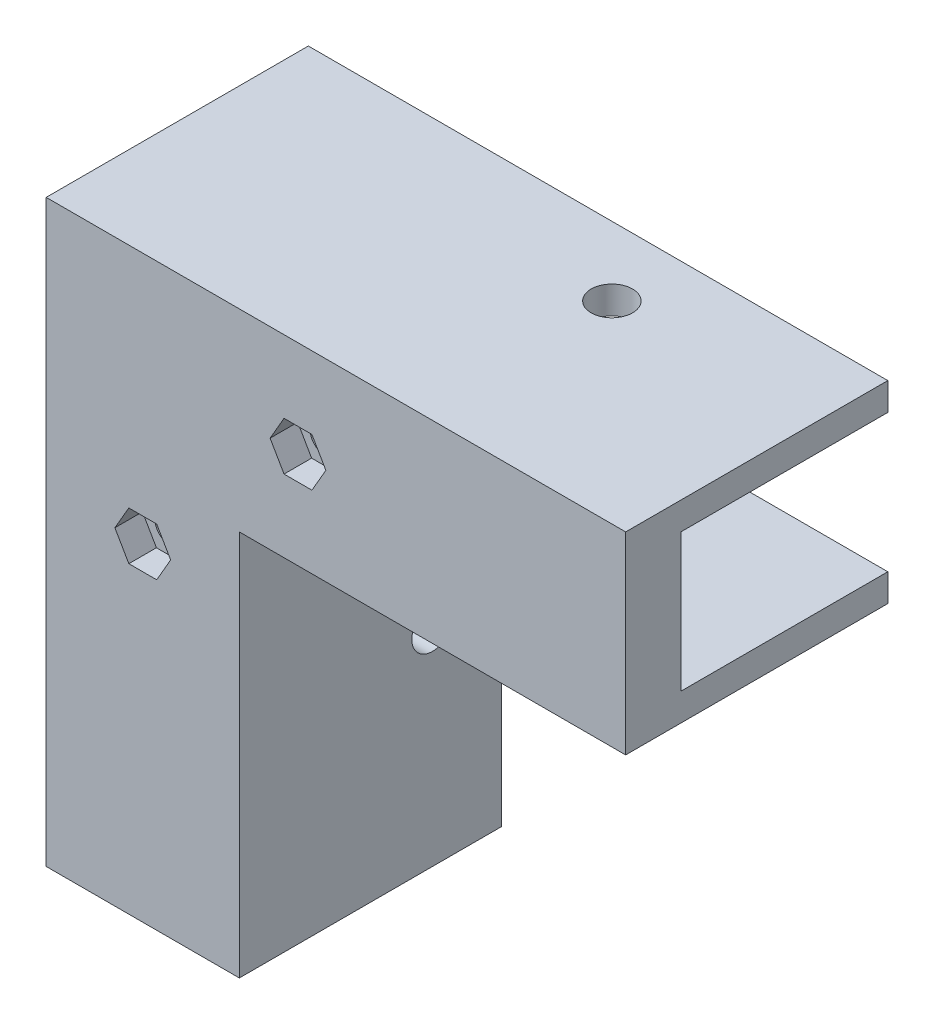
ISO-10303-21;
HEADER;
FILE_DESCRIPTION(('STEP AP214'),'2;1');
FILE_NAME('part.step','',(''),(''),'','','');
FILE_SCHEMA(('AUTOMOTIVE_DESIGN { 1 0 10303 214 1 1 1 1 }'));
ENDSEC;
DATA;
#1=APPLICATION_CONTEXT('core data for automotive mechanical design processes');
#2=APPLICATION_PROTOCOL_DEFINITION('international standard','automotive_design',2000,#1);
#3=PRODUCT_CONTEXT('',#1,'mechanical');
#4=PRODUCT('Part','Part','',(#3));
#5=PRODUCT_RELATED_PRODUCT_CATEGORY('part','',(#4));
#6=PRODUCT_DEFINITION_FORMATION('','',#4);
#7=PRODUCT_DEFINITION_CONTEXT('part definition',#1,'design');
#8=PRODUCT_DEFINITION('design','',#6,#7);
#9=PRODUCT_DEFINITION_SHAPE('','',#8);
#10=(LENGTH_UNIT() NAMED_UNIT(*) SI_UNIT(.MILLI.,.METRE.));
#11=(NAMED_UNIT(*) PLANE_ANGLE_UNIT() SI_UNIT($,.RADIAN.));
#12=(NAMED_UNIT(*) SI_UNIT($,.STERADIAN.) SOLID_ANGLE_UNIT());
#13=UNCERTAINTY_MEASURE_WITH_UNIT(LENGTH_MEASURE(1.E-05),#10,'distance_accuracy_value','');
#14=(GEOMETRIC_REPRESENTATION_CONTEXT(3) GLOBAL_UNCERTAINTY_ASSIGNED_CONTEXT((#13)) GLOBAL_UNIT_ASSIGNED_CONTEXT((#10,
#11,#12)) REPRESENTATION_CONTEXT('',''));
#15=CARTESIAN_POINT('',(0.,0.,0.));
#16=DIRECTION('',(0.,0.,1.));
#17=DIRECTION('',(1.,0.,0.));
#18=AXIS2_PLACEMENT_3D('',#15,#16,#17);
#19=CARTESIAN_POINT('',(0.,0.,8.));
#20=DIRECTION('',(0.,0.,1.));
#21=DIRECTION('',(1.,0.,0.));
#22=AXIS2_PLACEMENT_3D('',#19,#20,#21);
#23=PLANE('',#22);
#24=DIRECTION('',(1.,0.,0.));
#25=VECTOR('',#24,1.);
#26=CARTESIAN_POINT('',(-20.,0.,8.));
#27=LINE('',#26,#25);
#28=CARTESIAN_POINT('',(-24.,0.,8.));
#29=VERTEX_POINT('',#28);
#30=CARTESIAN_POINT('',(4.,0.,8.));
#31=VERTEX_POINT('',#30);
#32=EDGE_CURVE('E42',#29,#31,#27,.T.);
#33=ORIENTED_EDGE('',*,*,#32,.T.);
#34=DIRECTION('',(0.,1.,0.));
#35=VECTOR('',#34,1.);
#36=CARTESIAN_POINT('',(3.99999999999999,56.,8.));
#37=LINE('',#36,#35);
#38=CARTESIAN_POINT('',(3.99999999999999,56.,8.));
#39=VERTEX_POINT('',#38);
#40=EDGE_CURVE('E247',#31,#39,#37,.T.);
#41=ORIENTED_EDGE('',*,*,#40,.T.);
#42=DIRECTION('',(1.,0.,0.));
#43=VECTOR('',#42,1.);
#44=CARTESIAN_POINT('',(60.,56.,8.));
#45=LINE('',#44,#43);
#46=CARTESIAN_POINT('',(60.,56.,8.));
#47=VERTEX_POINT('',#46);
#48=EDGE_CURVE('E261',#39,#47,#45,.T.);
#49=ORIENTED_EDGE('',*,*,#48,.T.);
#50=DIRECTION('',(0.,1.,0.));
#51=VECTOR('',#50,1.);
#52=CARTESIAN_POINT('',(60.,60.,8.));
#53=LINE('',#52,#51);
#54=CARTESIAN_POINT('',(60.,84.,8.));
#55=VERTEX_POINT('',#54);
#56=EDGE_CURVE('E11',#47,#55,#53,.T.);
#57=ORIENTED_EDGE('',*,*,#56,.T.);
#58=DIRECTION('',(-1.,0.,0.));
#59=VECTOR('',#58,1.);
#60=CARTESIAN_POINT('',(60.,84.,8.));
#61=LINE('',#60,#59);
#62=CARTESIAN_POINT('',(-24.,84.,8.));
#63=VERTEX_POINT('',#62);
#64=EDGE_CURVE('E230',#55,#63,#61,.T.);
#65=ORIENTED_EDGE('',*,*,#64,.T.);
#66=DIRECTION('',(0.,-1.,0.));
#67=VECTOR('',#66,1.);
#68=CARTESIAN_POINT('',(-24.,84.,8.));
#69=LINE('',#68,#67);
#70=EDGE_CURVE('E227',#63,#29,#69,.T.);
#71=ORIENTED_EDGE('',*,*,#70,.T.);
#72=EDGE_LOOP('',(#33,#41,#49,#57,#65,#71));
#73=FACE_BOUND('',#72,.T.);
#74=DIRECTION('',(-1.,0.,0.));
#75=VECTOR('',#74,1.);
#76=CARTESIAN_POINT('',(0.,66.5,8.));
#77=LINE('',#76,#75);
#78=CARTESIAN_POINT('',(14.5207259421637,66.5,8.));
#79=VERTEX_POINT('',#78);
#80=CARTESIAN_POINT('',(10.4792740578363,66.5,8.));
#81=VERTEX_POINT('',#80);
#82=EDGE_CURVE('E365',#79,#81,#77,.T.);
#83=ORIENTED_EDGE('',*,*,#82,.T.);
#84=DIRECTION('',(-0.5,0.866025403784439,0.));
#85=VECTOR('',#84,1.);
#86=CARTESIAN_POINT('',(36.6548002192098,21.1626587736527,8.));
#87=LINE('',#86,#85);
#88=CARTESIAN_POINT('',(8.45854811567259,70.,8.));
#89=VERTEX_POINT('',#88);
#90=EDGE_CURVE('E58',#81,#89,#87,.T.);
#91=ORIENTED_EDGE('',*,*,#90,.T.);
#92=DIRECTION('',(0.499999999999996,0.866025403784441,0.));
#93=VECTOR('',#92,1.);
#94=CARTESIAN_POINT('',(-23.9669780457007,13.837341226347,8.));
#95=LINE('',#94,#93);
#96=CARTESIAN_POINT('',(10.4792740578363,73.5,8.));
#97=VERTEX_POINT('',#96);
#98=EDGE_CURVE('E353',#89,#97,#95,.T.);
#99=ORIENTED_EDGE('',*,*,#98,.T.);
#100=DIRECTION('',(1.,0.,0.));
#101=VECTOR('',#100,1.);
#102=CARTESIAN_POINT('',(0.,73.5,8.));
#103=LINE('',#102,#101);
#104=CARTESIAN_POINT('',(14.5207259421637,73.5,8.));
#105=VERTEX_POINT('',#104);
#106=EDGE_CURVE('E374',#97,#105,#103,.T.);
#107=ORIENTED_EDGE('',*,*,#106,.T.);
#108=DIRECTION('',(0.5,-0.866025403784439,0.));
#109=VECTOR('',#108,1.);
#110=CARTESIAN_POINT('',(42.7169780457009,24.6626587736527,8.));
#111=LINE('',#110,#109);
#112=CARTESIAN_POINT('',(16.5414518843274,70.,8.));
#113=VERTEX_POINT('',#112);
#114=EDGE_CURVE('E371',#105,#113,#111,.T.);
#115=ORIENTED_EDGE('',*,*,#114,.T.);
#116=DIRECTION('',(-0.500000000000001,-0.866025403784438,0.));
#117=VECTOR('',#116,1.);
#118=CARTESIAN_POINT('',(-17.9048002192099,10.3373412263473,8.));
#119=LINE('',#118,#117);
#120=EDGE_CURVE('E368',#113,#79,#119,.T.);
#121=ORIENTED_EDGE('',*,*,#120,.T.);
#122=EDGE_LOOP('',(#83,#91,#99,#107,#115,#121));
#123=FACE_BOUND('',#122,.T.);
#124=DIRECTION('',(-1.,0.,0.));
#125=VECTOR('',#124,1.);
#126=CARTESIAN_POINT('',(0.,44.,8.));
#127=LINE('',#126,#125);
#128=CARTESIAN_POINT('',(-7.97927405783629,44.,8.));
#129=VERTEX_POINT('',#128);
#130=CARTESIAN_POINT('',(-12.0207259421637,44.,8.));
#131=VERTEX_POINT('',#130);
#132=EDGE_CURVE('E324',#129,#131,#127,.T.);
#133=ORIENTED_EDGE('',*,*,#132,.T.);
#134=DIRECTION('',(-0.5,0.866025403784439,0.));
#135=VECTOR('',#134,1.);
#136=CARTESIAN_POINT('',(10.0370144266349,5.79487298107779,8.));
#137=LINE('',#136,#135);
#138=CARTESIAN_POINT('',(-14.0414518843274,47.5,8.));
#139=VERTEX_POINT('',#138);
#140=EDGE_CURVE('E50',#131,#139,#137,.T.);
#141=ORIENTED_EDGE('',*,*,#140,.T.);
#142=DIRECTION('',(0.5,0.866025403784438,0.));
#143=VECTOR('',#142,1.);
#144=CARTESIAN_POINT('',(-31.099192253126,17.9551270189222,8.));
#145=LINE('',#144,#143);
#146=CARTESIAN_POINT('',(-12.0207259421637,51.,8.));
#147=VERTEX_POINT('',#146);
#148=EDGE_CURVE('E312',#139,#147,#145,.T.);
#149=ORIENTED_EDGE('',*,*,#148,.T.);
#150=DIRECTION('',(1.,0.,0.));
#151=VECTOR('',#150,1.);
#152=CARTESIAN_POINT('',(-1.75126958938504E-13,51.,8.));
#153=LINE('',#152,#151);
#154=CARTESIAN_POINT('',(-7.97927405783632,51.,8.));
#155=VERTEX_POINT('',#154);
#156=EDGE_CURVE('E333',#147,#155,#153,.T.);
#157=ORIENTED_EDGE('',*,*,#156,.T.);
#158=DIRECTION('',(0.5,-0.866025403784439,0.));
#159=VECTOR('',#158,1.);
#160=CARTESIAN_POINT('',(16.0991922531259,9.29487298107778,8.));
#161=LINE('',#160,#159);
#162=CARTESIAN_POINT('',(-5.95854811567261,47.5,8.));
#163=VERTEX_POINT('',#162);
#164=EDGE_CURVE('E330',#155,#163,#161,.T.);
#165=ORIENTED_EDGE('',*,*,#164,.T.);
#166=DIRECTION('',(-0.499999999999999,-0.866025403784439,0.));
#167=VECTOR('',#166,1.);
#168=CARTESIAN_POINT('',(-25.0370144266349,14.4551270189221,8.));
#169=LINE('',#168,#167);
#170=EDGE_CURVE('E327',#163,#129,#169,.T.);
#171=ORIENTED_EDGE('',*,*,#170,.T.);
#172=EDGE_LOOP('',(#133,#141,#149,#157,#165,#171));
#173=FACE_BOUND('',#172,.T.);
#174=ADVANCED_FACE('F33',(#73,#123,#173),#23,.T.);
#175=CARTESIAN_POINT('',(-20.,0.,8.));
#176=DIRECTION('',(0.,1.,0.));
#177=DIRECTION('',(0.,0.,1.));
#178=AXIS2_PLACEMENT_3D('',#175,#176,#177);
#179=PLANE('',#178);
#180=DIRECTION('',(1.,0.,0.));
#181=VECTOR('',#180,1.);
#182=CARTESIAN_POINT('',(-20.,0.,0.));
#183=LINE('',#182,#181);
#184=CARTESIAN_POINT('',(-20.,0.,0.));
#185=VERTEX_POINT('',#184);
#186=CARTESIAN_POINT('',(0.,0.,0.));
#187=VERTEX_POINT('',#186);
#188=EDGE_CURVE('E381',#185,#187,#183,.T.);
#189=ORIENTED_EDGE('',*,*,#188,.T.);
#190=DIRECTION('',(0.,0.,1.));
#191=VECTOR('',#190,1.);
#192=CARTESIAN_POINT('',(0.,0.,-30.));
#193=LINE('',#192,#191);
#194=CARTESIAN_POINT('',(0.,0.,-30.));
#195=VERTEX_POINT('',#194);
#196=EDGE_CURVE('E281',#195,#187,#193,.T.);
#197=ORIENTED_EDGE('',*,*,#196,.F.);
#198=DIRECTION('',(1.,0.,0.));
#199=VECTOR('',#198,1.);
#200=CARTESIAN_POINT('',(4.,0.,-30.));
#201=LINE('',#200,#199);
#202=CARTESIAN_POINT('',(4.,0.,-30.));
#203=VERTEX_POINT('',#202);
#204=EDGE_CURVE('E257',#195,#203,#201,.T.);
#205=ORIENTED_EDGE('',*,*,#204,.T.);
#206=DIRECTION('',(0.,0.,1.));
#207=VECTOR('',#206,1.);
#208=CARTESIAN_POINT('',(4.,0.,-30.));
#209=LINE('',#208,#207);
#210=EDGE_CURVE('E276',#203,#31,#209,.T.);
#211=ORIENTED_EDGE('',*,*,#210,.T.);
#212=ORIENTED_EDGE('',*,*,#32,.F.);
#213=DIRECTION('',(0.,0.,1.));
#214=VECTOR('',#213,1.);
#215=CARTESIAN_POINT('',(-24.,0.,-30.));
#216=LINE('',#215,#214);
#217=CARTESIAN_POINT('',(-24.,0.,-30.));
#218=VERTEX_POINT('',#217);
#219=EDGE_CURVE('E251',#218,#29,#216,.T.);
#220=ORIENTED_EDGE('',*,*,#219,.F.);
#221=DIRECTION('',(1.,0.,0.));
#222=VECTOR('',#221,1.);
#223=CARTESIAN_POINT('',(-24.,0.,-30.));
#224=LINE('',#223,#222);
#225=CARTESIAN_POINT('',(-20.,0.,-30.));
#226=VERTEX_POINT('',#225);
#227=EDGE_CURVE('E240',#218,#226,#224,.T.);
#228=ORIENTED_EDGE('',*,*,#227,.T.);
#229=DIRECTION('',(0.,0.,1.));
#230=VECTOR('',#229,1.);
#231=CARTESIAN_POINT('',(-20.,0.,-30.));
#232=LINE('',#231,#230);
#233=EDGE_CURVE('E248',#226,#185,#232,.T.);
#234=ORIENTED_EDGE('',*,*,#233,.T.);
#235=EDGE_LOOP('',(#189,#197,#205,#211,#212,#220,#228,#234));
#236=FACE_BOUND('',#235,.T.);
#237=ADVANCED_FACE('F35',(#236),#179,.F.);
#238=CARTESIAN_POINT('',(60.,60.,8.));
#239=DIRECTION('',(-1.,0.,0.));
#240=DIRECTION('',(0.,0.,1.));
#241=AXIS2_PLACEMENT_3D('',#238,#239,#240);
#242=PLANE('',#241);
#243=DIRECTION('',(0.,1.,0.));
#244=VECTOR('',#243,1.);
#245=CARTESIAN_POINT('',(60.,60.,0.));
#246=LINE('',#245,#244);
#247=CARTESIAN_POINT('',(60.,60.,0.));
#248=VERTEX_POINT('',#247);
#249=CARTESIAN_POINT('',(60.,80.,0.));
#250=VERTEX_POINT('',#249);
#251=EDGE_CURVE('E205',#248,#250,#246,.T.);
#252=ORIENTED_EDGE('',*,*,#251,.T.);
#253=DIRECTION('',(0.,0.,1.));
#254=VECTOR('',#253,1.);
#255=CARTESIAN_POINT('',(60.,80.,-30.));
#256=LINE('',#255,#254);
#257=CARTESIAN_POINT('',(60.,80.,-30.));
#258=VERTEX_POINT('',#257);
#259=EDGE_CURVE('E199',#258,#250,#256,.T.);
#260=ORIENTED_EDGE('',*,*,#259,.F.);
#261=DIRECTION('',(0.,1.,0.));
#262=VECTOR('',#261,1.);
#263=CARTESIAN_POINT('',(60.,80.,-30.));
#264=LINE('',#263,#262);
#265=CARTESIAN_POINT('',(60.,84.,-30.));
#266=VERTEX_POINT('',#265);
#267=EDGE_CURVE('E203',#258,#266,#264,.T.);
#268=ORIENTED_EDGE('',*,*,#267,.T.);
#269=DIRECTION('',(0.,0.,1.));
#270=VECTOR('',#269,1.);
#271=CARTESIAN_POINT('',(60.,84.,-30.));
#272=LINE('',#271,#270);
#273=EDGE_CURVE('E210',#266,#55,#272,.T.);
#274=ORIENTED_EDGE('',*,*,#273,.T.);
#275=ORIENTED_EDGE('',*,*,#56,.F.);
#276=DIRECTION('',(0.,0.,1.));
#277=VECTOR('',#276,1.);
#278=CARTESIAN_POINT('',(60.,56.,-30.));
#279=LINE('',#278,#277);
#280=CARTESIAN_POINT('',(60.,56.,-30.));
#281=VERTEX_POINT('',#280);
#282=EDGE_CURVE('E290',#281,#47,#279,.T.);
#283=ORIENTED_EDGE('',*,*,#282,.F.);
#284=DIRECTION('',(0.,1.,0.));
#285=VECTOR('',#284,1.);
#286=CARTESIAN_POINT('',(60.,60.,-30.));
#287=LINE('',#286,#285);
#288=CARTESIAN_POINT('',(60.,60.,-30.));
#289=VERTEX_POINT('',#288);
#290=EDGE_CURVE('E267',#281,#289,#287,.T.);
#291=ORIENTED_EDGE('',*,*,#290,.T.);
#292=DIRECTION('',(0.,0.,1.));
#293=VECTOR('',#292,1.);
#294=CARTESIAN_POINT('',(60.,60.,-30.));
#295=LINE('',#294,#293);
#296=EDGE_CURVE('E288',#289,#248,#295,.T.);
#297=ORIENTED_EDGE('',*,*,#296,.T.);
#298=EDGE_LOOP('',(#252,#260,#268,#274,#275,#283,#291,#297));
#299=FACE_BOUND('',#298,.T.);
#300=ADVANCED_FACE('F201',(#299),#242,.F.);
#301=CARTESIAN_POINT('',(0.,0.,0.));
#302=DIRECTION('',(0.,0.,1.));
#303=DIRECTION('',(1.,0.,0.));
#304=AXIS2_PLACEMENT_3D('',#301,#302,#303);
#305=PLANE('',#304);
#306=CARTESIAN_POINT('',(12.5,70.,0.));
#307=DIRECTION('',(0.,0.,1.));
#308=DIRECTION('',(1.,0.,0.));
#309=AXIS2_PLACEMENT_3D('',#306,#307,#308);
#310=CIRCLE('',#309,2.25);
#311=CARTESIAN_POINT('',(14.75,70.,0.));
#312=VERTEX_POINT('',#311);
#313=EDGE_CURVE('E297',#312,#312,#310,.T.);
#314=ORIENTED_EDGE('',*,*,#313,.T.);
#315=EDGE_LOOP('',(#314));
#316=FACE_BOUND('',#315,.T.);
#317=CARTESIAN_POINT('',(-10.,47.5,0.));
#318=DIRECTION('',(0.,0.,1.));
#319=DIRECTION('',(1.,0.,0.));
#320=AXIS2_PLACEMENT_3D('',#317,#318,#319);
#321=CIRCLE('',#320,2.25);
#322=CARTESIAN_POINT('',(-7.75,47.5,0.));
#323=VERTEX_POINT('',#322);
#324=EDGE_CURVE('E303',#323,#323,#321,.T.);
#325=ORIENTED_EDGE('',*,*,#324,.T.);
#326=EDGE_LOOP('',(#325));
#327=FACE_BOUND('',#326,.T.);
#328=ORIENTED_EDGE('',*,*,#188,.F.);
#329=DIRECTION('',(0.,-1.,0.));
#330=VECTOR('',#329,1.);
#331=CARTESIAN_POINT('',(-20.,80.,0.));
#332=LINE('',#331,#330);
#333=CARTESIAN_POINT('',(-20.,80.,0.));
#334=VERTEX_POINT('',#333);
#335=EDGE_CURVE('E37',#334,#185,#332,.T.);
#336=ORIENTED_EDGE('',*,*,#335,.F.);
#337=DIRECTION('',(-1.,0.,0.));
#338=VECTOR('',#337,1.);
#339=CARTESIAN_POINT('',(60.,80.,0.));
#340=LINE('',#339,#338);
#341=EDGE_CURVE('E400',#250,#334,#340,.T.);
#342=ORIENTED_EDGE('',*,*,#341,.F.);
#343=ORIENTED_EDGE('',*,*,#251,.F.);
#344=DIRECTION('',(1.,0.,0.));
#345=VECTOR('',#344,1.);
#346=CARTESIAN_POINT('',(0.,60.,0.));
#347=LINE('',#346,#345);
#348=CARTESIAN_POINT('',(0.,60.,0.));
#349=VERTEX_POINT('',#348);
#350=EDGE_CURVE('E397',#349,#248,#347,.T.);
#351=ORIENTED_EDGE('',*,*,#350,.F.);
#352=DIRECTION('',(0.,1.,0.));
#353=VECTOR('',#352,1.);
#354=CARTESIAN_POINT('',(0.,0.,0.));
#355=LINE('',#354,#353);
#356=EDGE_CURVE('E394',#187,#349,#355,.T.);
#357=ORIENTED_EDGE('',*,*,#356,.F.);
#358=EDGE_LOOP('',(#328,#336,#342,#343,#351,#357));
#359=FACE_BOUND('',#358,.T.);
#360=ADVANCED_FACE('F431',(#316,#327,#359),#305,.F.);
#361=CARTESIAN_POINT('',(36.6548002192098,21.1626587736527,4.));
#362=DIRECTION('',(0.866025403784439,0.5,0.));
#363=DIRECTION('',(-0.5,0.866025403784439,0.));
#364=AXIS2_PLACEMENT_3D('',#361,#362,#363);
#365=PLANE('',#364);
#366=ORIENTED_EDGE('',*,*,#90,.F.);
#367=DIRECTION('',(0.,0.,1.));
#368=VECTOR('',#367,1.);
#369=CARTESIAN_POINT('',(10.4792740578363,66.5,4.));
#370=LINE('',#369,#368);
#371=CARTESIAN_POINT('',(10.4792740578363,66.5,4.));
#372=VERTEX_POINT('',#371);
#373=EDGE_CURVE('E363',#372,#81,#370,.T.);
#374=ORIENTED_EDGE('',*,*,#373,.F.);
#375=DIRECTION('',(-0.5,0.866025403784439,0.));
#376=VECTOR('',#375,1.);
#377=CARTESIAN_POINT('',(36.6548002192098,21.1626587736527,4.));
#378=LINE('',#377,#376);
#379=CARTESIAN_POINT('',(8.45854811567259,70.,4.));
#380=VERTEX_POINT('',#379);
#381=EDGE_CURVE('E349',#372,#380,#378,.T.);
#382=ORIENTED_EDGE('',*,*,#381,.T.);
#383=DIRECTION('',(0.,0.,1.));
#384=VECTOR('',#383,1.);
#385=CARTESIAN_POINT('',(8.45854811567259,70.,4.));
#386=LINE('',#385,#384);
#387=EDGE_CURVE('E379',#380,#89,#386,.T.);
#388=ORIENTED_EDGE('',*,*,#387,.T.);
#389=EDGE_LOOP('',(#366,#374,#382,#388));
#390=FACE_BOUND('',#389,.T.);
#391=ADVANCED_FACE('F457',(#390),#365,.T.);
#392=CARTESIAN_POINT('',(-23.9669780457007,13.837341226347,4.));
#393=DIRECTION('',(0.866025403784441,-0.499999999999996,0.));
#394=DIRECTION('',(0.499999999999996,0.866025403784441,0.));
#395=AXIS2_PLACEMENT_3D('',#392,#393,#394);
#396=PLANE('',#395);
#397=ORIENTED_EDGE('',*,*,#98,.F.);
#398=ORIENTED_EDGE('',*,*,#387,.F.);
#399=DIRECTION('',(0.499999999999996,0.866025403784441,0.));
#400=VECTOR('',#399,1.);
#401=CARTESIAN_POINT('',(-23.9669780457007,13.837341226347,4.));
#402=LINE('',#401,#400);
#403=CARTESIAN_POINT('',(10.4792740578363,73.5,4.));
#404=VERTEX_POINT('',#403);
#405=EDGE_CURVE('E361',#380,#404,#402,.T.);
#406=ORIENTED_EDGE('',*,*,#405,.T.);
#407=DIRECTION('',(0.,0.,1.));
#408=VECTOR('',#407,1.);
#409=CARTESIAN_POINT('',(10.4792740578363,73.5,4.));
#410=LINE('',#409,#408);
#411=EDGE_CURVE('E382',#404,#97,#410,.T.);
#412=ORIENTED_EDGE('',*,*,#411,.T.);
#413=EDGE_LOOP('',(#397,#398,#406,#412));
#414=FACE_BOUND('',#413,.T.);
#415=ADVANCED_FACE('F472',(#414),#396,.T.);
#416=CARTESIAN_POINT('',(0.,73.5,4.));
#417=DIRECTION('',(0.,-1.,0.));
#418=DIRECTION('',(0.,0.,-1.));
#419=AXIS2_PLACEMENT_3D('',#416,#417,#418);
#420=PLANE('',#419);
#421=ORIENTED_EDGE('',*,*,#106,.F.);
#422=ORIENTED_EDGE('',*,*,#411,.F.);
#423=DIRECTION('',(1.,0.,0.));
#424=VECTOR('',#423,1.);
#425=CARTESIAN_POINT('',(0.,73.5,4.));
#426=LINE('',#425,#424);
#427=CARTESIAN_POINT('',(14.5207259421637,73.5,4.));
#428=VERTEX_POINT('',#427);
#429=EDGE_CURVE('E359',#404,#428,#426,.T.);
#430=ORIENTED_EDGE('',*,*,#429,.T.);
#431=DIRECTION('',(0.,0.,1.));
#432=VECTOR('',#431,1.);
#433=CARTESIAN_POINT('',(14.5207259421637,73.5,4.));
#434=LINE('',#433,#432);
#435=EDGE_CURVE('E384',#428,#105,#434,.T.);
#436=ORIENTED_EDGE('',*,*,#435,.T.);
#437=EDGE_LOOP('',(#421,#422,#430,#436));
#438=FACE_BOUND('',#437,.T.);
#439=ADVANCED_FACE('F478',(#438),#420,.T.);
#440=CARTESIAN_POINT('',(42.7169780457009,24.6626587736527,4.));
#441=DIRECTION('',(-0.866025403784439,-0.5,0.));
#442=DIRECTION('',(0.5,-0.866025403784439,0.));
#443=AXIS2_PLACEMENT_3D('',#440,#441,#442);
#444=PLANE('',#443);
#445=ORIENTED_EDGE('',*,*,#114,.F.);
#446=ORIENTED_EDGE('',*,*,#435,.F.);
#447=DIRECTION('',(0.5,-0.866025403784439,0.));
#448=VECTOR('',#447,1.);
#449=CARTESIAN_POINT('',(42.7169780457009,24.6626587736527,4.));
#450=LINE('',#449,#448);
#451=CARTESIAN_POINT('',(16.5414518843274,70.,4.));
#452=VERTEX_POINT('',#451);
#453=EDGE_CURVE('E357',#428,#452,#450,.T.);
#454=ORIENTED_EDGE('',*,*,#453,.T.);
#455=DIRECTION('',(0.,0.,1.));
#456=VECTOR('',#455,1.);
#457=CARTESIAN_POINT('',(16.5414518843274,70.,4.));
#458=LINE('',#457,#456);
#459=EDGE_CURVE('E386',#452,#113,#458,.T.);
#460=ORIENTED_EDGE('',*,*,#459,.T.);
#461=EDGE_LOOP('',(#445,#446,#454,#460));
#462=FACE_BOUND('',#461,.T.);
#463=ADVANCED_FACE('F486',(#462),#444,.T.);
#464=CARTESIAN_POINT('',(-17.9048002192099,10.3373412263473,4.));
#465=DIRECTION('',(-0.866025403784438,0.500000000000001,0.));
#466=DIRECTION('',(-0.500000000000001,-0.866025403784438,0.));
#467=AXIS2_PLACEMENT_3D('',#464,#465,#466);
#468=PLANE('',#467);
#469=ORIENTED_EDGE('',*,*,#120,.F.);
#470=ORIENTED_EDGE('',*,*,#459,.F.);
#471=DIRECTION('',(-0.500000000000001,-0.866025403784438,0.));
#472=VECTOR('',#471,1.);
#473=CARTESIAN_POINT('',(-17.9048002192099,10.3373412263473,4.));
#474=LINE('',#473,#472);
#475=CARTESIAN_POINT('',(14.5207259421637,66.5,4.));
#476=VERTEX_POINT('',#475);
#477=EDGE_CURVE('E355',#452,#476,#474,.T.);
#478=ORIENTED_EDGE('',*,*,#477,.T.);
#479=DIRECTION('',(0.,0.,1.));
#480=VECTOR('',#479,1.);
#481=CARTESIAN_POINT('',(14.5207259421637,66.5,4.));
#482=LINE('',#481,#480);
#483=EDGE_CURVE('E388',#476,#79,#482,.T.);
#484=ORIENTED_EDGE('',*,*,#483,.T.);
#485=EDGE_LOOP('',(#469,#470,#478,#484));
#486=FACE_BOUND('',#485,.T.);
#487=ADVANCED_FACE('F494',(#486),#468,.T.);
#488=CARTESIAN_POINT('',(0.,66.5,4.));
#489=DIRECTION('',(0.,1.,0.));
#490=DIRECTION('',(0.,0.,1.));
#491=AXIS2_PLACEMENT_3D('',#488,#489,#490);
#492=PLANE('',#491);
#493=ORIENTED_EDGE('',*,*,#82,.F.);
#494=ORIENTED_EDGE('',*,*,#483,.F.);
#495=DIRECTION('',(-1.,0.,0.));
#496=VECTOR('',#495,1.);
#497=CARTESIAN_POINT('',(0.,66.5,4.));
#498=LINE('',#497,#496);
#499=EDGE_CURVE('E352',#476,#372,#498,.T.);
#500=ORIENTED_EDGE('',*,*,#499,.T.);
#501=ORIENTED_EDGE('',*,*,#373,.T.);
#502=EDGE_LOOP('',(#493,#494,#500,#501));
#503=FACE_BOUND('',#502,.T.);
#504=ADVANCED_FACE('F502',(#503),#492,.T.);
#505=CARTESIAN_POINT('',(0.,0.,4.));
#506=DIRECTION('',(0.,0.,1.));
#507=DIRECTION('',(1.,0.,0.));
#508=AXIS2_PLACEMENT_3D('',#505,#506,#507);
#509=PLANE('',#508);
#510=CARTESIAN_POINT('',(12.5,70.,4.));
#511=DIRECTION('',(0.,0.,1.));
#512=DIRECTION('',(1.,0.,0.));
#513=AXIS2_PLACEMENT_3D('',#510,#511,#512);
#514=CIRCLE('',#513,2.25);
#515=CARTESIAN_POINT('',(14.75,70.,4.));
#516=VERTEX_POINT('',#515);
#517=EDGE_CURVE('E284',#516,#516,#514,.T.);
#518=ORIENTED_EDGE('',*,*,#517,.F.);
#519=EDGE_LOOP('',(#518));
#520=FACE_BOUND('',#519,.T.);
#521=ORIENTED_EDGE('',*,*,#381,.F.);
#522=ORIENTED_EDGE('',*,*,#499,.F.);
#523=ORIENTED_EDGE('',*,*,#477,.F.);
#524=ORIENTED_EDGE('',*,*,#453,.F.);
#525=ORIENTED_EDGE('',*,*,#429,.F.);
#526=ORIENTED_EDGE('',*,*,#405,.F.);
#527=EDGE_LOOP('',(#521,#522,#523,#524,#525,#526));
#528=FACE_BOUND('',#527,.T.);
#529=ADVANCED_FACE('F510',(#520,#528),#509,.T.);
#530=CARTESIAN_POINT('',(10.0370144266349,5.79487298107779,4.));
#531=DIRECTION('',(0.866025403784439,0.5,0.));
#532=DIRECTION('',(-0.5,0.866025403784439,0.));
#533=AXIS2_PLACEMENT_3D('',#530,#531,#532);
#534=PLANE('',#533);
#535=ORIENTED_EDGE('',*,*,#140,.F.);
#536=DIRECTION('',(0.,0.,1.));
#537=VECTOR('',#536,1.);
#538=CARTESIAN_POINT('',(-12.0207259421637,44.,4.));
#539=LINE('',#538,#537);
#540=CARTESIAN_POINT('',(-12.0207259421637,44.,4.));
#541=VERTEX_POINT('',#540);
#542=EDGE_CURVE('E322',#541,#131,#539,.T.);
#543=ORIENTED_EDGE('',*,*,#542,.F.);
#544=DIRECTION('',(-0.5,0.866025403784439,0.));
#545=VECTOR('',#544,1.);
#546=CARTESIAN_POINT('',(10.0370144266349,5.79487298107779,4.));
#547=LINE('',#546,#545);
#548=CARTESIAN_POINT('',(-14.0414518843274,47.5,4.));
#549=VERTEX_POINT('',#548);
#550=EDGE_CURVE('E308',#541,#549,#547,.T.);
#551=ORIENTED_EDGE('',*,*,#550,.T.);
#552=DIRECTION('',(0.,0.,1.));
#553=VECTOR('',#552,1.);
#554=CARTESIAN_POINT('',(-14.0414518843274,47.5,4.));
#555=LINE('',#554,#553);
#556=EDGE_CURVE('E338',#549,#139,#555,.T.);
#557=ORIENTED_EDGE('',*,*,#556,.T.);
#558=EDGE_LOOP('',(#535,#543,#551,#557));
#559=FACE_BOUND('',#558,.T.);
#560=ADVANCED_FACE('F518',(#559),#534,.T.);
#561=CARTESIAN_POINT('',(-31.099192253126,17.9551270189222,4.));
#562=DIRECTION('',(0.866025403784438,-0.5,0.));
#563=DIRECTION('',(0.5,0.866025403784438,0.));
#564=AXIS2_PLACEMENT_3D('',#561,#562,#563);
#565=PLANE('',#564);
#566=ORIENTED_EDGE('',*,*,#148,.F.);
#567=ORIENTED_EDGE('',*,*,#556,.F.);
#568=DIRECTION('',(0.5,0.866025403784438,0.));
#569=VECTOR('',#568,1.);
#570=CARTESIAN_POINT('',(-31.099192253126,17.9551270189222,4.));
#571=LINE('',#570,#569);
#572=CARTESIAN_POINT('',(-12.0207259421637,51.,4.));
#573=VERTEX_POINT('',#572);
#574=EDGE_CURVE('E320',#549,#573,#571,.T.);
#575=ORIENTED_EDGE('',*,*,#574,.T.);
#576=DIRECTION('',(0.,0.,1.));
#577=VECTOR('',#576,1.);
#578=CARTESIAN_POINT('',(-12.0207259421637,51.,4.));
#579=LINE('',#578,#577);
#580=EDGE_CURVE('E340',#573,#147,#579,.T.);
#581=ORIENTED_EDGE('',*,*,#580,.T.);
#582=EDGE_LOOP('',(#566,#567,#575,#581));
#583=FACE_BOUND('',#582,.T.);
#584=ADVANCED_FACE('F527',(#583),#565,.T.);
#585=CARTESIAN_POINT('',(-1.75126958938504E-13,51.,4.));
#586=DIRECTION('',(0.,-1.,0.));
#587=DIRECTION('',(1.,0.,0.));
#588=AXIS2_PLACEMENT_3D('',#585,#586,#587);
#589=PLANE('',#588);
#590=ORIENTED_EDGE('',*,*,#156,.F.);
#591=ORIENTED_EDGE('',*,*,#580,.F.);
#592=DIRECTION('',(1.,0.,0.));
#593=VECTOR('',#592,1.);
#594=CARTESIAN_POINT('',(-1.75126958938504E-13,51.,4.));
#595=LINE('',#594,#593);
#596=CARTESIAN_POINT('',(-7.97927405783632,51.,4.));
#597=VERTEX_POINT('',#596);
#598=EDGE_CURVE('E318',#573,#597,#595,.T.);
#599=ORIENTED_EDGE('',*,*,#598,.T.);
#600=DIRECTION('',(0.,0.,1.));
#601=VECTOR('',#600,1.);
#602=CARTESIAN_POINT('',(-7.97927405783632,51.,4.));
#603=LINE('',#602,#601);
#604=EDGE_CURVE('E342',#597,#155,#603,.T.);
#605=ORIENTED_EDGE('',*,*,#604,.T.);
#606=EDGE_LOOP('',(#590,#591,#599,#605));
#607=FACE_BOUND('',#606,.T.);
#608=ADVANCED_FACE('F534',(#607),#589,.T.);
#609=CARTESIAN_POINT('',(16.0991922531259,9.29487298107778,4.));
#610=DIRECTION('',(-0.866025403784439,-0.499999999999999,0.));
#611=DIRECTION('',(0.5,-0.866025403784439,0.));
#612=AXIS2_PLACEMENT_3D('',#609,#610,#611);
#613=PLANE('',#612);
#614=ORIENTED_EDGE('',*,*,#164,.F.);
#615=ORIENTED_EDGE('',*,*,#604,.F.);
#616=DIRECTION('',(0.5,-0.866025403784439,0.));
#617=VECTOR('',#616,1.);
#618=CARTESIAN_POINT('',(16.0991922531259,9.29487298107778,4.));
#619=LINE('',#618,#617);
#620=CARTESIAN_POINT('',(-5.95854811567261,47.5,4.));
#621=VERTEX_POINT('',#620);
#622=EDGE_CURVE('E316',#597,#621,#619,.T.);
#623=ORIENTED_EDGE('',*,*,#622,.T.);
#624=DIRECTION('',(0.,0.,1.));
#625=VECTOR('',#624,1.);
#626=CARTESIAN_POINT('',(-5.95854811567261,47.5,4.));
#627=LINE('',#626,#625);
#628=EDGE_CURVE('E344',#621,#163,#627,.T.);
#629=ORIENTED_EDGE('',*,*,#628,.T.);
#630=EDGE_LOOP('',(#614,#615,#623,#629));
#631=FACE_BOUND('',#630,.T.);
#632=ADVANCED_FACE('F542',(#631),#613,.T.);
#633=CARTESIAN_POINT('',(-25.0370144266349,14.4551270189221,4.));
#634=DIRECTION('',(-0.866025403784439,0.499999999999999,0.));
#635=DIRECTION('',(-0.499999999999999,-0.866025403784439,0.));
#636=AXIS2_PLACEMENT_3D('',#633,#634,#635);
#637=PLANE('',#636);
#638=ORIENTED_EDGE('',*,*,#170,.F.);
#639=ORIENTED_EDGE('',*,*,#628,.F.);
#640=DIRECTION('',(-0.499999999999999,-0.866025403784439,0.));
#641=VECTOR('',#640,1.);
#642=CARTESIAN_POINT('',(-25.0370144266349,14.4551270189221,4.));
#643=LINE('',#642,#641);
#644=CARTESIAN_POINT('',(-7.97927405783629,44.,4.));
#645=VERTEX_POINT('',#644);
#646=EDGE_CURVE('E314',#621,#645,#643,.T.);
#647=ORIENTED_EDGE('',*,*,#646,.T.);
#648=DIRECTION('',(0.,0.,1.));
#649=VECTOR('',#648,1.);
#650=CARTESIAN_POINT('',(-7.97927405783629,44.,4.));
#651=LINE('',#650,#649);
#652=EDGE_CURVE('E346',#645,#129,#651,.T.);
#653=ORIENTED_EDGE('',*,*,#652,.T.);
#654=EDGE_LOOP('',(#638,#639,#647,#653));
#655=FACE_BOUND('',#654,.T.);
#656=ADVANCED_FACE('F550',(#655),#637,.T.);
#657=CARTESIAN_POINT('',(0.,44.,4.));
#658=DIRECTION('',(0.,1.,0.));
#659=DIRECTION('',(-1.,0.,0.));
#660=AXIS2_PLACEMENT_3D('',#657,#658,#659);
#661=PLANE('',#660);
#662=ORIENTED_EDGE('',*,*,#132,.F.);
#663=ORIENTED_EDGE('',*,*,#652,.F.);
#664=DIRECTION('',(-1.,0.,0.));
#665=VECTOR('',#664,1.);
#666=CARTESIAN_POINT('',(0.,44.,4.));
#667=LINE('',#666,#665);
#668=EDGE_CURVE('E311',#645,#541,#667,.T.);
#669=ORIENTED_EDGE('',*,*,#668,.T.);
#670=ORIENTED_EDGE('',*,*,#542,.T.);
#671=EDGE_LOOP('',(#662,#663,#669,#670));
#672=FACE_BOUND('',#671,.T.);
#673=ADVANCED_FACE('F558',(#672),#661,.T.);
#674=CARTESIAN_POINT('',(0.,0.,4.));
#675=DIRECTION('',(0.,0.,1.));
#676=DIRECTION('',(1.,0.,0.));
#677=AXIS2_PLACEMENT_3D('',#674,#675,#676);
#678=PLANE('',#677);
#679=CARTESIAN_POINT('',(-10.,47.5,4.));
#680=DIRECTION('',(0.,0.,1.));
#681=DIRECTION('',(1.,0.,0.));
#682=AXIS2_PLACEMENT_3D('',#679,#680,#681);
#683=CIRCLE('',#682,2.25);
#684=CARTESIAN_POINT('',(-7.75,47.5,4.));
#685=VERTEX_POINT('',#684);
#686=EDGE_CURVE('E300',#685,#685,#683,.T.);
#687=ORIENTED_EDGE('',*,*,#686,.F.);
#688=EDGE_LOOP('',(#687));
#689=FACE_BOUND('',#688,.T.);
#690=ORIENTED_EDGE('',*,*,#550,.F.);
#691=ORIENTED_EDGE('',*,*,#668,.F.);
#692=ORIENTED_EDGE('',*,*,#646,.F.);
#693=ORIENTED_EDGE('',*,*,#622,.F.);
#694=ORIENTED_EDGE('',*,*,#598,.F.);
#695=ORIENTED_EDGE('',*,*,#574,.F.);
#696=EDGE_LOOP('',(#690,#691,#692,#693,#694,#695));
#697=FACE_BOUND('',#696,.T.);
#698=ADVANCED_FACE('F565',(#689,#697),#678,.T.);
#699=CARTESIAN_POINT('',(-10.,47.5,0.));
#700=DIRECTION('',(0.,0.,1.));
#701=DIRECTION('',(1.,0.,0.));
#702=AXIS2_PLACEMENT_3D('',#699,#700,#701);
#703=CYLINDRICAL_SURFACE('',#702,2.25);
#704=ORIENTED_EDGE('',*,*,#324,.F.);
#705=EDGE_LOOP('',(#704));
#706=FACE_BOUND('',#705,.T.);
#707=ORIENTED_EDGE('',*,*,#686,.T.);
#708=EDGE_LOOP('',(#707));
#709=FACE_BOUND('',#708,.T.);
#710=ADVANCED_FACE('F444',(#706,#709),#703,.F.);
#711=CARTESIAN_POINT('',(12.5,70.,0.));
#712=DIRECTION('',(0.,0.,1.));
#713=DIRECTION('',(1.,0.,0.));
#714=AXIS2_PLACEMENT_3D('',#711,#712,#713);
#715=CYLINDRICAL_SURFACE('',#714,2.25);
#716=ORIENTED_EDGE('',*,*,#313,.F.);
#717=EDGE_LOOP('',(#716));
#718=FACE_BOUND('',#717,.T.);
#719=ORIENTED_EDGE('',*,*,#517,.T.);
#720=EDGE_LOOP('',(#719));
#721=FACE_BOUND('',#720,.T.);
#722=ADVANCED_FACE('F435',(#718,#721),#715,.F.);
#723=CARTESIAN_POINT('',(0.,0.,-30.));
#724=DIRECTION('',(-1.,0.,0.));
#725=DIRECTION('',(0.,0.,1.));
#726=AXIS2_PLACEMENT_3D('',#723,#724,#725);
#727=PLANE('',#726);
#728=CARTESIAN_POINT('',(0.,30.,-20.));
#729=DIRECTION('',(-1.,0.,0.));
#730=DIRECTION('',(0.,0.,1.));
#731=AXIS2_PLACEMENT_3D('',#728,#729,#730);
#732=CIRCLE('',#731,3.);
#733=CARTESIAN_POINT('',(0.,30.,-17.));
#734=VERTEX_POINT('',#733);
#735=EDGE_CURVE('E729',#734,#734,#732,.T.);
#736=ORIENTED_EDGE('',*,*,#735,.F.);
#737=EDGE_LOOP('',(#736));
#738=FACE_BOUND('',#737,.T.);
#739=ORIENTED_EDGE('',*,*,#356,.T.);
#740=DIRECTION('',(0.,0.,1.));
#741=VECTOR('',#740,1.);
#742=CARTESIAN_POINT('',(0.,60.,-30.));
#743=LINE('',#742,#741);
#744=CARTESIAN_POINT('',(0.,60.,-30.));
#745=VERTEX_POINT('',#744);
#746=EDGE_CURVE('E285',#745,#349,#743,.T.);
#747=ORIENTED_EDGE('',*,*,#746,.F.);
#748=DIRECTION('',(0.,-1.,0.));
#749=VECTOR('',#748,1.);
#750=CARTESIAN_POINT('',(0.,0.,-30.));
#751=LINE('',#750,#749);
#752=EDGE_CURVE('E273',#745,#195,#751,.T.);
#753=ORIENTED_EDGE('',*,*,#752,.T.);
#754=ORIENTED_EDGE('',*,*,#196,.T.);
#755=EDGE_LOOP('',(#739,#747,#753,#754));
#756=FACE_BOUND('',#755,.T.);
#757=ADVANCED_FACE('F433',(#738,#756),#727,.T.);
#758=CARTESIAN_POINT('',(0.,60.,-30.));
#759=DIRECTION('',(0.,1.,0.));
#760=DIRECTION('',(0.,0.,1.));
#761=AXIS2_PLACEMENT_3D('',#758,#759,#760);
#762=PLANE('',#761);
#763=CARTESIAN_POINT('',(30.,60.,-20.));
#764=DIRECTION('',(0.,1.,0.));
#765=DIRECTION('',(0.,0.,1.));
#766=AXIS2_PLACEMENT_3D('',#763,#764,#765);
#767=CIRCLE('',#766,3.);
#768=CARTESIAN_POINT('',(30.,60.,-17.));
#769=VERTEX_POINT('',#768);
#770=EDGE_CURVE('E233',#769,#769,#767,.T.);
#771=ORIENTED_EDGE('',*,*,#770,.F.);
#772=EDGE_LOOP('',(#771));
#773=FACE_BOUND('',#772,.T.);
#774=ORIENTED_EDGE('',*,*,#350,.T.);
#775=ORIENTED_EDGE('',*,*,#296,.F.);
#776=DIRECTION('',(-1.,0.,0.));
#777=VECTOR('',#776,1.);
#778=CARTESIAN_POINT('',(0.,60.,-30.));
#779=LINE('',#778,#777);
#780=EDGE_CURVE('E270',#289,#745,#779,.T.);
#781=ORIENTED_EDGE('',*,*,#780,.T.);
#782=ORIENTED_EDGE('',*,*,#746,.T.);
#783=EDGE_LOOP('',(#774,#775,#781,#782));
#784=FACE_BOUND('',#783,.T.);
#785=ADVANCED_FACE('F430',(#773,#784),#762,.T.);
#786=CARTESIAN_POINT('',(60.,56.,-30.));
#787=DIRECTION('',(0.,-1.,0.));
#788=DIRECTION('',(1.,0.,0.));
#789=AXIS2_PLACEMENT_3D('',#786,#787,#788);
#790=PLANE('',#789);
#791=CARTESIAN_POINT('',(30.,56.,-20.));
#792=DIRECTION('',(0.,-1.,0.));
#793=DIRECTION('',(1.,0.,0.));
#794=AXIS2_PLACEMENT_3D('',#791,#792,#793);
#795=CIRCLE('',#794,3.);
#796=CARTESIAN_POINT('',(33.,56.,-20.));
#797=VERTEX_POINT('',#796);
#798=EDGE_CURVE('E742',#797,#797,#795,.T.);
#799=ORIENTED_EDGE('',*,*,#798,.F.);
#800=EDGE_LOOP('',(#799));
#801=FACE_BOUND('',#800,.T.);
#802=ORIENTED_EDGE('',*,*,#48,.F.);
#803=DIRECTION('',(0.,0.,1.));
#804=VECTOR('',#803,1.);
#805=CARTESIAN_POINT('',(3.99999999999999,56.,-30.));
#806=LINE('',#805,#804);
#807=CARTESIAN_POINT('',(3.99999999999999,56.,-30.));
#808=VERTEX_POINT('',#807);
#809=EDGE_CURVE('E293',#808,#39,#806,.T.);
#810=ORIENTED_EDGE('',*,*,#809,.F.);
#811=DIRECTION('',(1.,0.,0.));
#812=VECTOR('',#811,1.);
#813=CARTESIAN_POINT('',(60.,56.,-30.));
#814=LINE('',#813,#812);
#815=EDGE_CURVE('E264',#808,#281,#814,.T.);
#816=ORIENTED_EDGE('',*,*,#815,.T.);
#817=ORIENTED_EDGE('',*,*,#282,.T.);
#818=EDGE_LOOP('',(#802,#810,#816,#817));
#819=FACE_BOUND('',#818,.T.);
#820=ADVANCED_FACE('F417',(#801,#819),#790,.T.);
#821=CARTESIAN_POINT('',(3.99999999999999,56.,-30.));
#822=DIRECTION('',(1.,0.,0.));
#823=DIRECTION('',(0.,1.,0.));
#824=AXIS2_PLACEMENT_3D('',#821,#822,#823);
#825=PLANE('',#824);
#826=CARTESIAN_POINT('',(3.99999999999999,30.,-20.));
#827=DIRECTION('',(1.,0.,0.));
#828=DIRECTION('',(0.,1.,0.));
#829=AXIS2_PLACEMENT_3D('',#826,#827,#828);
#830=CIRCLE('',#829,3.);
#831=CARTESIAN_POINT('',(3.99999999999999,33.,-20.));
#832=VERTEX_POINT('',#831);
#833=EDGE_CURVE('E732',#832,#832,#830,.T.);
#834=ORIENTED_EDGE('',*,*,#833,.F.);
#835=EDGE_LOOP('',(#834));
#836=FACE_BOUND('',#835,.T.);
#837=ORIENTED_EDGE('',*,*,#40,.F.);
#838=ORIENTED_EDGE('',*,*,#210,.F.);
#839=DIRECTION('',(0.,1.,0.));
#840=VECTOR('',#839,1.);
#841=CARTESIAN_POINT('',(3.99999999999999,56.,-30.));
#842=LINE('',#841,#840);
#843=EDGE_CURVE('E260',#203,#808,#842,.T.);
#844=ORIENTED_EDGE('',*,*,#843,.T.);
#845=ORIENTED_EDGE('',*,*,#809,.T.);
#846=EDGE_LOOP('',(#837,#838,#844,#845));
#847=FACE_BOUND('',#846,.T.);
#848=ADVANCED_FACE('F422',(#836,#847),#825,.T.);
#849=CARTESIAN_POINT('',(0.,0.,-30.));
#850=DIRECTION('',(0.,0.,-1.));
#851=DIRECTION('',(-1.,0.,0.));
#852=AXIS2_PLACEMENT_3D('',#849,#850,#851);
#853=PLANE('',#852);
#854=ORIENTED_EDGE('',*,*,#204,.F.);
#855=ORIENTED_EDGE('',*,*,#752,.F.);
#856=ORIENTED_EDGE('',*,*,#780,.F.);
#857=ORIENTED_EDGE('',*,*,#290,.F.);
#858=ORIENTED_EDGE('',*,*,#815,.F.);
#859=ORIENTED_EDGE('',*,*,#843,.F.);
#860=EDGE_LOOP('',(#854,#855,#856,#857,#858,#859));
#861=FACE_BOUND('',#860,.T.);
#862=ADVANCED_FACE('F426',(#861),#853,.T.);
#863=CARTESIAN_POINT('',(-20.,80.,-30.));
#864=DIRECTION('',(0.,-1.,0.));
#865=DIRECTION('',(1.,0.,0.));
#866=AXIS2_PLACEMENT_3D('',#863,#864,#865);
#867=PLANE('',#866);
#868=CARTESIAN_POINT('',(30.,80.,-20.));
#869=DIRECTION('',(0.,-1.,0.));
#870=DIRECTION('',(1.,0.,0.));
#871=AXIS2_PLACEMENT_3D('',#868,#869,#870);
#872=CIRCLE('',#871,3.);
#873=CARTESIAN_POINT('',(33.,80.,-20.));
#874=VERTEX_POINT('',#873);
#875=EDGE_CURVE('E746',#874,#874,#872,.T.);
#876=ORIENTED_EDGE('',*,*,#875,.F.);
#877=EDGE_LOOP('',(#876));
#878=FACE_BOUND('',#877,.T.);
#879=ORIENTED_EDGE('',*,*,#341,.T.);
#880=DIRECTION('',(0.,0.,1.));
#881=VECTOR('',#880,1.);
#882=CARTESIAN_POINT('',(-20.,80.,-30.));
#883=LINE('',#882,#881);
#884=CARTESIAN_POINT('',(-20.,80.,-30.));
#885=VERTEX_POINT('',#884);
#886=EDGE_CURVE('E226',#885,#334,#883,.T.);
#887=ORIENTED_EDGE('',*,*,#886,.F.);
#888=DIRECTION('',(1.,0.,0.));
#889=VECTOR('',#888,1.);
#890=CARTESIAN_POINT('',(-20.,80.,-30.));
#891=LINE('',#890,#889);
#892=EDGE_CURVE('E218',#885,#258,#891,.T.);
#893=ORIENTED_EDGE('',*,*,#892,.T.);
#894=ORIENTED_EDGE('',*,*,#259,.T.);
#895=EDGE_LOOP('',(#879,#887,#893,#894));
#896=FACE_BOUND('',#895,.T.);
#897=ADVANCED_FACE('F224',(#878,#896),#867,.T.);
#898=CARTESIAN_POINT('',(-20.,0.,-30.));
#899=DIRECTION('',(1.,0.,0.));
#900=DIRECTION('',(0.,0.,-1.));
#901=AXIS2_PLACEMENT_3D('',#898,#899,#900);
#902=PLANE('',#901);
#903=CARTESIAN_POINT('',(-20.,30.,-20.));
#904=DIRECTION('',(1.,0.,0.));
#905=DIRECTION('',(0.,0.,-1.));
#906=AXIS2_PLACEMENT_3D('',#903,#904,#905);
#907=CIRCLE('',#906,3.);
#908=CARTESIAN_POINT('',(-20.,30.,-23.));
#909=VERTEX_POINT('',#908);
#910=EDGE_CURVE('E736',#909,#909,#907,.T.);
#911=ORIENTED_EDGE('',*,*,#910,.F.);
#912=EDGE_LOOP('',(#911));
#913=FACE_BOUND('',#912,.T.);
#914=ORIENTED_EDGE('',*,*,#335,.T.);
#915=ORIENTED_EDGE('',*,*,#233,.F.);
#916=DIRECTION('',(0.,1.,0.));
#917=VECTOR('',#916,1.);
#918=CARTESIAN_POINT('',(-20.,0.,-30.));
#919=LINE('',#918,#917);
#920=EDGE_CURVE('E211',#226,#885,#919,.T.);
#921=ORIENTED_EDGE('',*,*,#920,.T.);
#922=ORIENTED_EDGE('',*,*,#886,.T.);
#923=EDGE_LOOP('',(#914,#915,#921,#922));
#924=FACE_BOUND('',#923,.T.);
#925=ADVANCED_FACE('F403',(#913,#924),#902,.T.);
#926=CARTESIAN_POINT('',(-24.,84.,-30.));
#927=DIRECTION('',(-1.,0.,0.));
#928=DIRECTION('',(0.,-1.,0.));
#929=AXIS2_PLACEMENT_3D('',#926,#927,#928);
#930=PLANE('',#929);
#931=CARTESIAN_POINT('',(-24.,30.,-20.));
#932=DIRECTION('',(1.,0.,0.));
#933=DIRECTION('',(0.,1.,0.));
#934=AXIS2_PLACEMENT_3D('',#931,#932,#933);
#935=CIRCLE('',#934,3.);
#936=CARTESIAN_POINT('',(-24.,33.,-20.));
#937=VERTEX_POINT('',#936);
#938=EDGE_CURVE('E733',#937,#937,#935,.T.);
#939=ORIENTED_EDGE('',*,*,#938,.T.);
#940=EDGE_LOOP('',(#939));
#941=FACE_BOUND('',#940,.T.);
#942=ORIENTED_EDGE('',*,*,#70,.F.);
#943=DIRECTION('',(0.,0.,1.));
#944=VECTOR('',#943,1.);
#945=CARTESIAN_POINT('',(-24.,84.,-30.));
#946=LINE('',#945,#944);
#947=CARTESIAN_POINT('',(-24.,84.,-30.));
#948=VERTEX_POINT('',#947);
#949=EDGE_CURVE('E254',#948,#63,#946,.T.);
#950=ORIENTED_EDGE('',*,*,#949,.F.);
#951=DIRECTION('',(0.,-1.,0.));
#952=VECTOR('',#951,1.);
#953=CARTESIAN_POINT('',(-24.,84.,-30.));
#954=LINE('',#953,#952);
#955=EDGE_CURVE('E237',#948,#218,#954,.T.);
#956=ORIENTED_EDGE('',*,*,#955,.T.);
#957=ORIENTED_EDGE('',*,*,#219,.T.);
#958=EDGE_LOOP('',(#942,#950,#956,#957));
#959=FACE_BOUND('',#958,.T.);
#960=ADVANCED_FACE('F409',(#941,#959),#930,.T.);
#961=CARTESIAN_POINT('',(60.,84.,-30.));
#962=DIRECTION('',(0.,1.,0.));
#963=DIRECTION('',(-1.,0.,0.));
#964=AXIS2_PLACEMENT_3D('',#961,#962,#963);
#965=PLANE('',#964);
#966=CARTESIAN_POINT('',(30.,84.,-20.));
#967=DIRECTION('',(0.,-1.,0.));
#968=DIRECTION('',(1.,0.,0.));
#969=AXIS2_PLACEMENT_3D('',#966,#967,#968);
#970=CIRCLE('',#969,3.);
#971=CARTESIAN_POINT('',(33.,84.,-20.));
#972=VERTEX_POINT('',#971);
#973=EDGE_CURVE('E743',#972,#972,#970,.T.);
#974=ORIENTED_EDGE('',*,*,#973,.T.);
#975=EDGE_LOOP('',(#974));
#976=FACE_BOUND('',#975,.T.);
#977=ORIENTED_EDGE('',*,*,#64,.F.);
#978=ORIENTED_EDGE('',*,*,#273,.F.);
#979=DIRECTION('',(-1.,0.,0.));
#980=VECTOR('',#979,1.);
#981=CARTESIAN_POINT('',(60.,84.,-30.));
#982=LINE('',#981,#980);
#983=EDGE_CURVE('E222',#266,#948,#982,.T.);
#984=ORIENTED_EDGE('',*,*,#983,.T.);
#985=ORIENTED_EDGE('',*,*,#949,.T.);
#986=EDGE_LOOP('',(#977,#978,#984,#985));
#987=FACE_BOUND('',#986,.T.);
#988=ADVANCED_FACE('F412',(#976,#987),#965,.T.);
#989=CARTESIAN_POINT('',(0.,0.,-30.));
#990=DIRECTION('',(0.,0.,1.));
#991=DIRECTION('',(1.,0.,0.));
#992=AXIS2_PLACEMENT_3D('',#989,#990,#991);
#993=PLANE('',#992);
#994=ORIENTED_EDGE('',*,*,#892,.F.);
#995=ORIENTED_EDGE('',*,*,#920,.F.);
#996=ORIENTED_EDGE('',*,*,#227,.F.);
#997=ORIENTED_EDGE('',*,*,#955,.F.);
#998=ORIENTED_EDGE('',*,*,#983,.F.);
#999=ORIENTED_EDGE('',*,*,#267,.F.);
#1000=EDGE_LOOP('',(#994,#995,#996,#997,#998,#999));
#1001=FACE_BOUND('',#1000,.T.);
#1002=ADVANCED_FACE('F216',(#1001),#993,.F.);
#1003=CARTESIAN_POINT('',(30.,84.,-20.));
#1004=DIRECTION('',(0.,-1.,0.));
#1005=DIRECTION('',(1.,0.,0.));
#1006=AXIS2_PLACEMENT_3D('',#1003,#1004,#1005);
#1007=CYLINDRICAL_SURFACE('',#1006,3.);
#1008=ORIENTED_EDGE('',*,*,#875,.T.);
#1009=EDGE_LOOP('',(#1008));
#1010=FACE_BOUND('',#1009,.T.);
#1011=ORIENTED_EDGE('',*,*,#973,.F.);
#1012=EDGE_LOOP('',(#1011));
#1013=FACE_BOUND('',#1012,.T.);
#1014=ADVANCED_FACE('F682',(#1010,#1013),#1007,.F.);
#1015=ORIENTED_EDGE('',*,*,#770,.T.);
#1016=EDGE_LOOP('',(#1015));
#1017=FACE_BOUND('',#1016,.T.);
#1018=ORIENTED_EDGE('',*,*,#798,.T.);
#1019=EDGE_LOOP('',(#1018));
#1020=FACE_BOUND('',#1019,.T.);
#1021=ADVANCED_FACE('F689',(#1017,#1020),#1007,.F.);
#1022=CARTESIAN_POINT('',(-24.,30.,-20.));
#1023=DIRECTION('',(1.,0.,0.));
#1024=DIRECTION('',(0.,1.,0.));
#1025=AXIS2_PLACEMENT_3D('',#1022,#1023,#1024);
#1026=CYLINDRICAL_SURFACE('',#1025,3.);
#1027=ORIENTED_EDGE('',*,*,#910,.T.);
#1028=EDGE_LOOP('',(#1027));
#1029=FACE_BOUND('',#1028,.T.);
#1030=ORIENTED_EDGE('',*,*,#938,.F.);
#1031=EDGE_LOOP('',(#1030));
#1032=FACE_BOUND('',#1031,.T.);
#1033=ADVANCED_FACE('F697',(#1029,#1032),#1026,.F.);
#1034=ORIENTED_EDGE('',*,*,#735,.T.);
#1035=EDGE_LOOP('',(#1034));
#1036=FACE_BOUND('',#1035,.T.);
#1037=ORIENTED_EDGE('',*,*,#833,.T.);
#1038=EDGE_LOOP('',(#1037));
#1039=FACE_BOUND('',#1038,.T.);
#1040=ADVANCED_FACE('F704',(#1036,#1039),#1026,.F.);
#1041=CLOSED_SHELL('',(#174,#237,#300,#360,#391,#415,#439,#463,#487,#504,#529,#560,#584,#608,
#632,#656,#673,#698,#710,#722,#757,#785,#820,#848,#862,#897,#925,#960,#988,#1002,#1014,#1021,
#1033,#1040));
#1042=MANIFOLD_SOLID_BREP('B2',#1041);
#1043=ADVANCED_BREP_SHAPE_REPRESENTATION('',(#18,#1042),#14);
#1044=SHAPE_DEFINITION_REPRESENTATION(#9,#1043);
ENDSEC;
END-ISO-10303-21;
